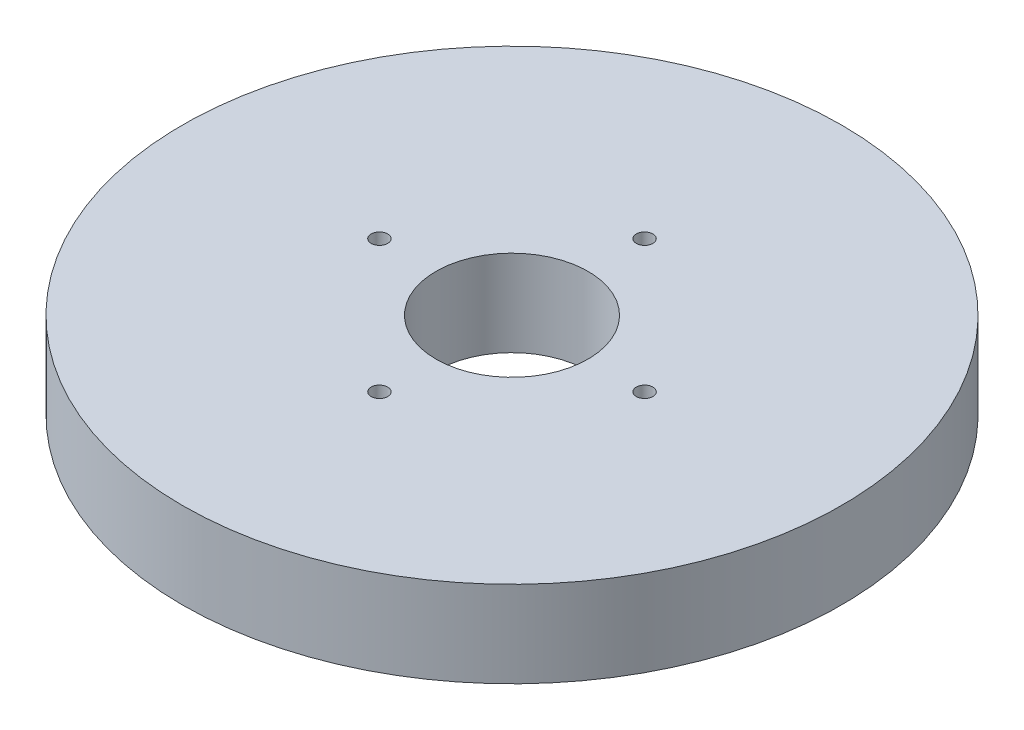
ISO-10303-21;
HEADER;
FILE_DESCRIPTION(('STEP AP214'),'2;1');
FILE_NAME('part.step','',(''),(''),'','','');
FILE_SCHEMA(('AUTOMOTIVE_DESIGN { 1 0 10303 214 1 1 1 1 }'));
ENDSEC;
DATA;
#1=APPLICATION_CONTEXT('core data for automotive mechanical design processes');
#2=APPLICATION_PROTOCOL_DEFINITION('international standard','automotive_design',2000,#1);
#3=PRODUCT_CONTEXT('',#1,'mechanical');
#4=PRODUCT('Part','Part','',(#3));
#5=PRODUCT_RELATED_PRODUCT_CATEGORY('part','',(#4));
#6=PRODUCT_DEFINITION_FORMATION('','',#4);
#7=PRODUCT_DEFINITION_CONTEXT('part definition',#1,'design');
#8=PRODUCT_DEFINITION('design','',#6,#7);
#9=PRODUCT_DEFINITION_SHAPE('','',#8);
#10=(LENGTH_UNIT() NAMED_UNIT(*) SI_UNIT(.MILLI.,.METRE.));
#11=(NAMED_UNIT(*) PLANE_ANGLE_UNIT() SI_UNIT($,.RADIAN.));
#12=(NAMED_UNIT(*) SI_UNIT($,.STERADIAN.) SOLID_ANGLE_UNIT());
#13=UNCERTAINTY_MEASURE_WITH_UNIT(LENGTH_MEASURE(1.E-05),#10,'distance_accuracy_value','');
#14=(GEOMETRIC_REPRESENTATION_CONTEXT(3) GLOBAL_UNCERTAINTY_ASSIGNED_CONTEXT((#13)) GLOBAL_UNIT_ASSIGNED_CONTEXT((#10,
#11,#12)) REPRESENTATION_CONTEXT('',''));
#15=CARTESIAN_POINT('',(0.,0.,0.));
#16=DIRECTION('',(0.,0.,1.));
#17=DIRECTION('',(1.,0.,0.));
#18=AXIS2_PLACEMENT_3D('',#15,#16,#17);
#19=CARTESIAN_POINT('',(0.,17.,0.));
#20=DIRECTION('',(0.,-1.,0.));
#21=DIRECTION('',(0.,0.,-1.));
#22=AXIS2_PLACEMENT_3D('',#19,#20,#21);
#23=CYLINDRICAL_SURFACE('',#22,65.);
#24=CARTESIAN_POINT('',(0.,17.,0.));
#25=DIRECTION('',(0.,1.,0.));
#26=DIRECTION('',(0.,0.,1.));
#27=AXIS2_PLACEMENT_3D('',#24,#25,#26);
#28=CIRCLE('',#27,65.);
#29=CARTESIAN_POINT('',(0.,17.,65.));
#30=VERTEX_POINT('',#29);
#31=EDGE_CURVE('E10',#30,#30,#28,.T.);
#32=ORIENTED_EDGE('',*,*,#31,.F.);
#33=EDGE_LOOP('',(#32));
#34=FACE_BOUND('',#33,.T.);
#35=CARTESIAN_POINT('',(0.,0.,0.));
#36=DIRECTION('',(0.,1.,0.));
#37=DIRECTION('',(0.,0.,1.));
#38=AXIS2_PLACEMENT_3D('',#35,#36,#37);
#39=CIRCLE('',#38,65.);
#40=CARTESIAN_POINT('',(0.,0.,65.));
#41=VERTEX_POINT('',#40);
#42=EDGE_CURVE('E37',#41,#41,#39,.T.);
#43=ORIENTED_EDGE('',*,*,#42,.T.);
#44=EDGE_LOOP('',(#43));
#45=FACE_BOUND('',#44,.T.);
#46=ADVANCED_FACE('F40',(#34,#45),#23,.T.);
#47=CARTESIAN_POINT('',(0.,17.,0.));
#48=DIRECTION('',(0.,1.,0.));
#49=DIRECTION('',(0.,0.,1.));
#50=AXIS2_PLACEMENT_3D('',#47,#48,#49);
#51=PLANE('',#50);
#52=CARTESIAN_POINT('',(0.,17.,26.1531605797637));
#53=DIRECTION('',(0.,1.,0.));
#54=DIRECTION('',(1.,0.,0.));
#55=AXIS2_PLACEMENT_3D('',#52,#53,#54);
#56=CIRCLE('',#55,1.63087072446358);
#57=CARTESIAN_POINT('',(1.63087072446368,17.,26.1531605797637));
#58=VERTEX_POINT('',#57);
#59=EDGE_CURVE('E71',#58,#58,#56,.T.);
#60=ORIENTED_EDGE('',*,*,#59,.F.);
#61=EDGE_LOOP('',(#60));
#62=FACE_BOUND('',#61,.T.);
#63=CARTESIAN_POINT('',(26.1531605797637,17.,0.));
#64=DIRECTION('',(0.,1.,0.));
#65=DIRECTION('',(0.,0.,-1.));
#66=AXIS2_PLACEMENT_3D('',#63,#64,#65);
#67=CIRCLE('',#66,1.63087072446358);
#68=CARTESIAN_POINT('',(26.1531605797637,17.,-1.63087072446358));
#69=VERTEX_POINT('',#68);
#70=EDGE_CURVE('E70',#69,#69,#67,.T.);
#71=ORIENTED_EDGE('',*,*,#70,.F.);
#72=EDGE_LOOP('',(#71));
#73=FACE_BOUND('',#72,.T.);
#74=CARTESIAN_POINT('',(-2.73939816348039E-13,17.,-26.1531605797637));
#75=DIRECTION('',(0.,1.,0.));
#76=DIRECTION('',(-1.,0.,0.));
#77=AXIS2_PLACEMENT_3D('',#74,#75,#76);
#78=CIRCLE('',#77,1.63087072446358);
#79=CARTESIAN_POINT('',(-1.63087072446386,17.,-26.1531605797637));
#80=VERTEX_POINT('',#79);
#81=EDGE_CURVE('E61',#80,#80,#78,.T.);
#82=ORIENTED_EDGE('',*,*,#81,.F.);
#83=EDGE_LOOP('',(#82));
#84=FACE_BOUND('',#83,.T.);
#85=CARTESIAN_POINT('',(-26.1531605797637,17.,0.));
#86=DIRECTION('',(0.,1.,0.));
#87=DIRECTION('',(0.,0.,1.));
#88=AXIS2_PLACEMENT_3D('',#85,#86,#87);
#89=CIRCLE('',#88,1.63087072446358);
#90=CARTESIAN_POINT('',(-26.1531605797637,17.,1.63087072446358));
#91=VERTEX_POINT('',#90);
#92=EDGE_CURVE('E54',#91,#91,#89,.T.);
#93=ORIENTED_EDGE('',*,*,#92,.F.);
#94=EDGE_LOOP('',(#93));
#95=FACE_BOUND('',#94,.T.);
#96=CARTESIAN_POINT('',(0.,17.,0.));
#97=DIRECTION('',(0.,1.,0.));
#98=DIRECTION('',(0.,0.,1.));
#99=AXIS2_PLACEMENT_3D('',#96,#97,#98);
#100=CIRCLE('',#99,15.);
#101=CARTESIAN_POINT('',(0.,17.,15.));
#102=VERTEX_POINT('',#101);
#103=EDGE_CURVE('E50',#102,#102,#100,.T.);
#104=ORIENTED_EDGE('',*,*,#103,.F.);
#105=EDGE_LOOP('',(#104));
#106=FACE_BOUND('',#105,.T.);
#107=ORIENTED_EDGE('',*,*,#31,.T.);
#108=EDGE_LOOP('',(#107));
#109=FACE_BOUND('',#108,.T.);
#110=ADVANCED_FACE('F86',(#62,#73,#84,#95,#106,#109),#51,.T.);
#111=CARTESIAN_POINT('',(0.,0.,0.));
#112=DIRECTION('',(0.,1.,0.));
#113=DIRECTION('',(0.,0.,1.));
#114=AXIS2_PLACEMENT_3D('',#111,#112,#113);
#115=PLANE('',#114);
#116=CARTESIAN_POINT('',(0.,0.,0.));
#117=DIRECTION('',(0.,1.,0.));
#118=DIRECTION('',(0.,0.,1.));
#119=AXIS2_PLACEMENT_3D('',#116,#117,#118);
#120=CIRCLE('',#119,15.);
#121=CARTESIAN_POINT('',(0.,0.,15.));
#122=VERTEX_POINT('',#121);
#123=EDGE_CURVE('E47',#122,#122,#120,.T.);
#124=ORIENTED_EDGE('',*,*,#123,.T.);
#125=EDGE_LOOP('',(#124));
#126=FACE_BOUND('',#125,.T.);
#127=ORIENTED_EDGE('',*,*,#42,.F.);
#128=EDGE_LOOP('',(#127));
#129=FACE_BOUND('',#128,.T.);
#130=ADVANCED_FACE('F93',(#126,#129),#115,.F.);
#131=CARTESIAN_POINT('',(0.,17.,0.));
#132=DIRECTION('',(0.,-1.,0.));
#133=DIRECTION('',(0.,0.,-1.));
#134=AXIS2_PLACEMENT_3D('',#131,#132,#133);
#135=CYLINDRICAL_SURFACE('',#134,15.);
#136=ORIENTED_EDGE('',*,*,#103,.T.);
#137=EDGE_LOOP('',(#136));
#138=FACE_BOUND('',#137,.T.);
#139=ORIENTED_EDGE('',*,*,#123,.F.);
#140=EDGE_LOOP('',(#139));
#141=FACE_BOUND('',#140,.T.);
#142=ADVANCED_FACE('F101',(#138,#141),#135,.F.);
#143=CARTESIAN_POINT('',(-26.1531605797637,5.98179265360633,0.));
#144=DIRECTION('',(0.,1.,0.));
#145=DIRECTION('',(0.,0.,1.));
#146=AXIS2_PLACEMENT_3D('',#143,#144,#145);
#147=CYLINDRICAL_SURFACE('',#146,1.63087072446358);
#148=CARTESIAN_POINT('',(-26.1531605797637,5.98179265360633,0.));
#149=DIRECTION('',(0.,1.,0.));
#150=DIRECTION('',(0.,0.,1.));
#151=AXIS2_PLACEMENT_3D('',#148,#149,#150);
#152=CIRCLE('',#151,1.63087072446358);
#153=CARTESIAN_POINT('',(-26.1531605797637,5.98179265360633,1.63087072446358));
#154=VERTEX_POINT('',#153);
#155=EDGE_CURVE('E55',#154,#154,#152,.T.);
#156=ORIENTED_EDGE('',*,*,#155,.F.);
#157=EDGE_LOOP('',(#156));
#158=FACE_BOUND('',#157,.T.);
#159=ORIENTED_EDGE('',*,*,#92,.T.);
#160=EDGE_LOOP('',(#159));
#161=FACE_BOUND('',#160,.T.);
#162=ADVANCED_FACE('F102',(#158,#161),#147,.F.);
#163=CARTESIAN_POINT('',(-26.1531605797637,5.98179265360633,0.));
#164=DIRECTION('',(0.,1.,0.));
#165=DIRECTION('',(0.,0.,1.));
#166=AXIS2_PLACEMENT_3D('',#163,#164,#165);
#167=PLANE('',#166);
#168=ORIENTED_EDGE('',*,*,#155,.T.);
#169=EDGE_LOOP('',(#168));
#170=FACE_BOUND('',#169,.T.);
#171=ADVANCED_FACE('F133',(#170),#167,.T.);
#172=CARTESIAN_POINT('',(-2.73939816348039E-13,5.98179265360633,-26.1531605797637));
#173=DIRECTION('',(0.,1.,0.));
#174=DIRECTION('',(0.,0.,1.));
#175=AXIS2_PLACEMENT_3D('',#172,#173,#174);
#176=CYLINDRICAL_SURFACE('',#175,1.63087072446358);
#177=CARTESIAN_POINT('',(-2.73939816348039E-13,5.98179265360633,-26.1531605797637));
#178=DIRECTION('',(0.,1.,0.));
#179=DIRECTION('',(-1.,0.,0.));
#180=AXIS2_PLACEMENT_3D('',#177,#178,#179);
#181=CIRCLE('',#180,1.63087072446358);
#182=CARTESIAN_POINT('',(-1.63087072446386,5.98179265360633,-26.1531605797637));
#183=VERTEX_POINT('',#182);
#184=EDGE_CURVE('E63',#183,#183,#181,.T.);
#185=ORIENTED_EDGE('',*,*,#184,.F.);
#186=EDGE_LOOP('',(#185));
#187=FACE_BOUND('',#186,.T.);
#188=ORIENTED_EDGE('',*,*,#81,.T.);
#189=EDGE_LOOP('',(#188));
#190=FACE_BOUND('',#189,.T.);
#191=ADVANCED_FACE('F142',(#187,#190),#176,.F.);
#192=CARTESIAN_POINT('',(-2.73939816348039E-13,5.98179265360633,-26.1531605797637));
#193=DIRECTION('',(0.,1.,0.));
#194=DIRECTION('',(-1.,0.,0.));
#195=AXIS2_PLACEMENT_3D('',#192,#193,#194);
#196=PLANE('',#195);
#197=ORIENTED_EDGE('',*,*,#184,.T.);
#198=EDGE_LOOP('',(#197));
#199=FACE_BOUND('',#198,.T.);
#200=ADVANCED_FACE('F156',(#199),#196,.T.);
#201=CARTESIAN_POINT('',(26.1531605797637,5.98179265360633,0.));
#202=DIRECTION('',(0.,1.,0.));
#203=DIRECTION('',(0.,0.,1.));
#204=AXIS2_PLACEMENT_3D('',#201,#202,#203);
#205=CYLINDRICAL_SURFACE('',#204,1.63087072446358);
#206=CARTESIAN_POINT('',(26.1531605797637,5.98179265360633,0.));
#207=DIRECTION('',(0.,1.,0.));
#208=DIRECTION('',(0.,0.,-1.));
#209=AXIS2_PLACEMENT_3D('',#206,#207,#208);
#210=CIRCLE('',#209,1.63087072446358);
#211=CARTESIAN_POINT('',(26.1531605797637,5.98179265360633,-1.63087072446358));
#212=VERTEX_POINT('',#211);
#213=EDGE_CURVE('E69',#212,#212,#210,.T.);
#214=ORIENTED_EDGE('',*,*,#213,.F.);
#215=EDGE_LOOP('',(#214));
#216=FACE_BOUND('',#215,.T.);
#217=ORIENTED_EDGE('',*,*,#70,.T.);
#218=EDGE_LOOP('',(#217));
#219=FACE_BOUND('',#218,.T.);
#220=ADVANCED_FACE('F164',(#216,#219),#205,.F.);
#221=CARTESIAN_POINT('',(26.1531605797637,5.98179265360633,0.));
#222=DIRECTION('',(0.,1.,0.));
#223=DIRECTION('',(0.,0.,-1.));
#224=AXIS2_PLACEMENT_3D('',#221,#222,#223);
#225=PLANE('',#224);
#226=ORIENTED_EDGE('',*,*,#213,.T.);
#227=EDGE_LOOP('',(#226));
#228=FACE_BOUND('',#227,.T.);
#229=ADVANCED_FACE('F83',(#228),#225,.T.);
#230=CARTESIAN_POINT('',(0.,5.98179265360633,26.1531605797637));
#231=DIRECTION('',(0.,1.,0.));
#232=DIRECTION('',(0.,0.,1.));
#233=AXIS2_PLACEMENT_3D('',#230,#231,#232);
#234=CYLINDRICAL_SURFACE('',#233,1.63087072446358);
#235=CARTESIAN_POINT('',(0.,5.98179265360633,26.1531605797637));
#236=DIRECTION('',(0.,1.,0.));
#237=DIRECTION('',(1.,0.,0.));
#238=AXIS2_PLACEMENT_3D('',#235,#236,#237);
#239=CIRCLE('',#238,1.63087072446358);
#240=CARTESIAN_POINT('',(1.63087072446368,5.98179265360633,26.1531605797637));
#241=VERTEX_POINT('',#240);
#242=EDGE_CURVE('E59',#241,#241,#239,.T.);
#243=ORIENTED_EDGE('',*,*,#242,.F.);
#244=EDGE_LOOP('',(#243));
#245=FACE_BOUND('',#244,.T.);
#246=ORIENTED_EDGE('',*,*,#59,.T.);
#247=EDGE_LOOP('',(#246));
#248=FACE_BOUND('',#247,.T.);
#249=ADVANCED_FACE('F81',(#245,#248),#234,.F.);
#250=CARTESIAN_POINT('',(0.,5.98179265360633,26.1531605797637));
#251=DIRECTION('',(0.,1.,0.));
#252=DIRECTION('',(1.,0.,0.));
#253=AXIS2_PLACEMENT_3D('',#250,#251,#252);
#254=PLANE('',#253);
#255=ORIENTED_EDGE('',*,*,#242,.T.);
#256=EDGE_LOOP('',(#255));
#257=FACE_BOUND('',#256,.T.);
#258=ADVANCED_FACE('F78',(#257),#254,.T.);
#259=CLOSED_SHELL('',(#46,#110,#130,#142,#162,#171,#191,#200,#220,#229,#249,#258));
#260=MANIFOLD_SOLID_BREP('B2',#259);
#261=ADVANCED_BREP_SHAPE_REPRESENTATION('',(#18,#260),#14);
#262=SHAPE_DEFINITION_REPRESENTATION(#9,#261);
ENDSEC;
END-ISO-10303-21;
